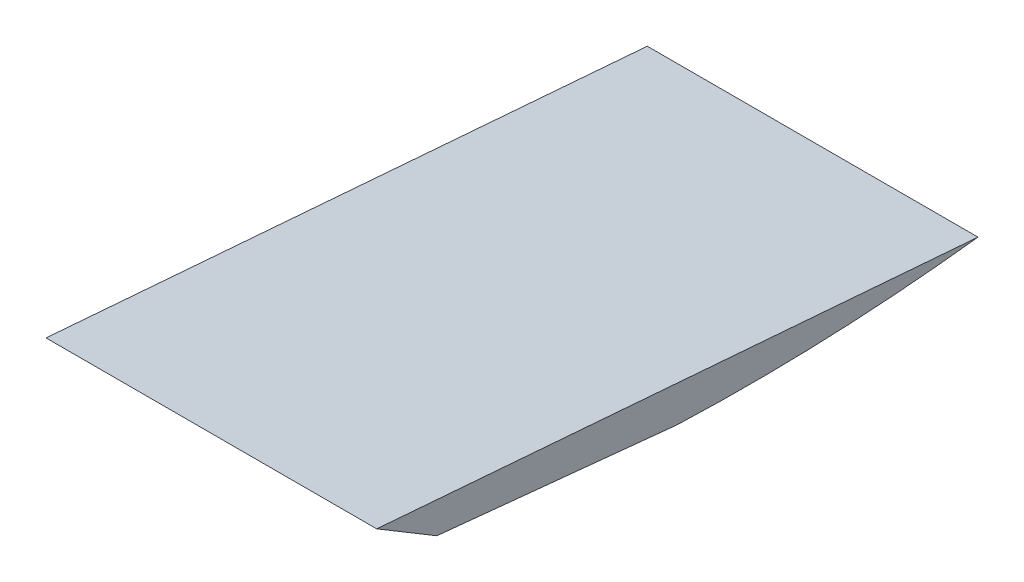
ISO-10303-21;
HEADER;
FILE_DESCRIPTION(('STEP AP214'),'2;1');
FILE_NAME('part.step','',(''),(''),'','','');
FILE_SCHEMA(('AUTOMOTIVE_DESIGN { 1 0 10303 214 1 1 1 1 }'));
ENDSEC;
DATA;
#1=APPLICATION_CONTEXT('core data for automotive mechanical design processes');
#2=APPLICATION_PROTOCOL_DEFINITION('international standard','automotive_design',2000,#1);
#3=PRODUCT_CONTEXT('',#1,'mechanical');
#4=PRODUCT('Part','Part','',(#3));
#5=PRODUCT_RELATED_PRODUCT_CATEGORY('part','',(#4));
#6=PRODUCT_DEFINITION_FORMATION('','',#4);
#7=PRODUCT_DEFINITION_CONTEXT('part definition',#1,'design');
#8=PRODUCT_DEFINITION('design','',#6,#7);
#9=PRODUCT_DEFINITION_SHAPE('','',#8);
#10=(LENGTH_UNIT() NAMED_UNIT(*) SI_UNIT(.MILLI.,.METRE.));
#11=(NAMED_UNIT(*) PLANE_ANGLE_UNIT() SI_UNIT($,.RADIAN.));
#12=(NAMED_UNIT(*) SI_UNIT($,.STERADIAN.) SOLID_ANGLE_UNIT());
#13=UNCERTAINTY_MEASURE_WITH_UNIT(LENGTH_MEASURE(1.E-05),#10,'distance_accuracy_value','');
#14=(GEOMETRIC_REPRESENTATION_CONTEXT(3) GLOBAL_UNCERTAINTY_ASSIGNED_CONTEXT((#13)) GLOBAL_UNIT_ASSIGNED_CONTEXT((#10,
#11,#12)) REPRESENTATION_CONTEXT('',''));
#15=CARTESIAN_POINT('',(0.,0.,0.));
#16=DIRECTION('',(0.,0.,1.));
#17=DIRECTION('',(1.,0.,0.));
#18=AXIS2_PLACEMENT_3D('',#15,#16,#17);
#19=CARTESIAN_POINT('',(13.75,3.,5.));
#20=DIRECTION('',(0.,0.857492925712544,-0.514495755427526));
#21=DIRECTION('',(0.,0.514495755427526,0.857492925712544));
#22=AXIS2_PLACEMENT_3D('',#19,#20,#21);
#23=PLANE('',#22);
#24=DIRECTION('',(0.,-0.514495755427526,-0.857492925712544));
#25=VECTOR('',#24,1.);
#26=CARTESIAN_POINT('',(-13.75,3.,5.));
#27=LINE('',#26,#25);
#28=CARTESIAN_POINT('',(-13.75,3.,5.));
#29=VERTEX_POINT('',#28);
#30=CARTESIAN_POINT('',(-13.75,0.,0.));
#31=VERTEX_POINT('',#30);
#32=EDGE_CURVE('E109',#29,#31,#27,.T.);
#33=ORIENTED_EDGE('',*,*,#32,.T.);
#34=DIRECTION('',(-1.,0.,0.));
#35=VECTOR('',#34,1.);
#36=CARTESIAN_POINT('',(13.75,0.,0.));
#37=LINE('',#36,#35);
#38=CARTESIAN_POINT('',(13.75,0.,0.));
#39=VERTEX_POINT('',#38);
#40=EDGE_CURVE('E11',#39,#31,#37,.T.);
#41=ORIENTED_EDGE('',*,*,#40,.F.);
#42=DIRECTION('',(0.,-0.514495755427526,-0.857492925712544));
#43=VECTOR('',#42,1.);
#44=CARTESIAN_POINT('',(13.75,3.,5.));
#45=LINE('',#44,#43);
#46=CARTESIAN_POINT('',(13.75,3.,5.));
#47=VERTEX_POINT('',#46);
#48=EDGE_CURVE('E93',#47,#39,#45,.T.);
#49=ORIENTED_EDGE('',*,*,#48,.F.);
#50=DIRECTION('',(-1.,0.,0.));
#51=VECTOR('',#50,1.);
#52=CARTESIAN_POINT('',(13.75,3.,5.));
#53=LINE('',#52,#51);
#54=EDGE_CURVE('E105',#47,#29,#53,.T.);
#55=ORIENTED_EDGE('',*,*,#54,.T.);
#56=EDGE_LOOP('',(#33,#41,#49,#55));
#57=FACE_BOUND('',#56,.T.);
#58=ADVANCED_FACE('F41',(#57),#23,.F.);
#59=CARTESIAN_POINT('',(13.75,0.,0.));
#60=DIRECTION('',(0.,0.995037190209989,-0.0995037190209989));
#61=DIRECTION('',(0.,0.0995037190209989,0.995037190209989));
#62=AXIS2_PLACEMENT_3D('',#59,#60,#61);
#63=PLANE('',#62);
#64=DIRECTION('',(0.,-0.0995037190209989,-0.995037190209989));
#65=VECTOR('',#64,1.);
#66=CARTESIAN_POINT('',(-13.75,0.,0.));
#67=LINE('',#66,#65);
#68=CARTESIAN_POINT('',(-13.75,-2.,-20.));
#69=VERTEX_POINT('',#68);
#70=EDGE_CURVE('E98',#31,#69,#67,.T.);
#71=ORIENTED_EDGE('',*,*,#70,.T.);
#72=DIRECTION('',(-1.,0.,0.));
#73=VECTOR('',#72,1.);
#74=CARTESIAN_POINT('',(13.75,-2.,-20.));
#75=LINE('',#74,#73);
#76=CARTESIAN_POINT('',(13.75,-2.,-20.));
#77=VERTEX_POINT('',#76);
#78=EDGE_CURVE('E50',#77,#69,#75,.T.);
#79=ORIENTED_EDGE('',*,*,#78,.F.);
#80=DIRECTION('',(0.,-0.0995037190209989,-0.995037190209989));
#81=VECTOR('',#80,1.);
#82=CARTESIAN_POINT('',(13.75,0.,0.));
#83=LINE('',#82,#81);
#84=EDGE_CURVE('E88',#39,#77,#83,.T.);
#85=ORIENTED_EDGE('',*,*,#84,.F.);
#86=ORIENTED_EDGE('',*,*,#40,.T.);
#87=EDGE_LOOP('',(#71,#79,#85,#86));
#88=FACE_BOUND('',#87,.T.);
#89=ADVANCED_FACE('F97',(#88),#63,.F.);
#90=CARTESIAN_POINT('',(13.75,157.88434424532,-26.0824719682095));
#91=DIRECTION('',(-1.,0.,0.));
#92=DIRECTION('',(0.,0.,1.));
#93=AXIS2_PLACEMENT_3D('',#90,#91,#92);
#94=CYLINDRICAL_SURFACE('',#93,160.);
#95=CARTESIAN_POINT('',(-13.75,157.88434424532,-26.0824719682095));
#96=DIRECTION('',(1.,0.,0.));
#97=DIRECTION('',(0.,0.,1.));
#98=AXIS2_PLACEMENT_3D('',#95,#96,#97);
#99=CIRCLE('',#98,160.);
#100=CARTESIAN_POINT('',(-13.75,-0.993367008230189,-45.));
#101=VERTEX_POINT('',#100);
#102=EDGE_CURVE('E75',#69,#101,#99,.T.);
#103=ORIENTED_EDGE('',*,*,#102,.T.);
#104=DIRECTION('',(-1.,0.,0.));
#105=VECTOR('',#104,1.);
#106=CARTESIAN_POINT('',(13.75,-0.993367008230189,-45.));
#107=LINE('',#106,#105);
#108=CARTESIAN_POINT('',(13.75,-0.993367008230189,-45.));
#109=VERTEX_POINT('',#108);
#110=EDGE_CURVE('E100',#109,#101,#107,.T.);
#111=ORIENTED_EDGE('',*,*,#110,.F.);
#112=CARTESIAN_POINT('',(13.75,157.88434424532,-26.0824719682095));
#113=DIRECTION('',(1.,0.,0.));
#114=DIRECTION('',(0.,0.,1.));
#115=AXIS2_PLACEMENT_3D('',#112,#113,#114);
#116=CIRCLE('',#115,160.);
#117=EDGE_CURVE('E91',#77,#109,#116,.T.);
#118=ORIENTED_EDGE('',*,*,#117,.F.);
#119=ORIENTED_EDGE('',*,*,#78,.T.);
#120=EDGE_LOOP('',(#103,#111,#118,#119));
#121=FACE_BOUND('',#120,.T.);
#122=ADVANCED_FACE('F101',(#121),#94,.T.);
#123=CARTESIAN_POINT('',(13.75,-0.993367008230173,-45.));
#124=DIRECTION('',(0.,-0.996825781699711,0.0796138237918575));
#125=DIRECTION('',(0.,-0.0796138237918575,-0.996825781699711));
#126=AXIS2_PLACEMENT_3D('',#123,#124,#125);
#127=PLANE('',#126);
#128=DIRECTION('',(0.,0.0796138237918575,0.996825781699711));
#129=VECTOR('',#128,1.);
#130=CARTESIAN_POINT('',(-13.75,-0.993367008230173,-45.));
#131=LINE('',#130,#129);
#132=EDGE_CURVE('E81',#101,#29,#131,.T.);
#133=ORIENTED_EDGE('',*,*,#132,.T.);
#134=ORIENTED_EDGE('',*,*,#54,.F.);
#135=DIRECTION('',(0.,0.0796138237918575,0.996825781699711));
#136=VECTOR('',#135,1.);
#137=CARTESIAN_POINT('',(13.75,-0.993367008230173,-45.));
#138=LINE('',#137,#136);
#139=EDGE_CURVE('E58',#109,#47,#138,.T.);
#140=ORIENTED_EDGE('',*,*,#139,.F.);
#141=ORIENTED_EDGE('',*,*,#110,.T.);
#142=EDGE_LOOP('',(#133,#134,#140,#141));
#143=FACE_BOUND('',#142,.T.);
#144=ADVANCED_FACE('F122',(#143),#127,.F.);
#145=CARTESIAN_POINT('',(13.75,157.88434424532,-26.0824719682095));
#146=DIRECTION('',(-1.,0.,0.));
#147=DIRECTION('',(0.,0.,1.));
#148=AXIS2_PLACEMENT_3D('',#145,#146,#147);
#149=PLANE('',#148);
#150=ORIENTED_EDGE('',*,*,#48,.T.);
#151=ORIENTED_EDGE('',*,*,#84,.T.);
#152=ORIENTED_EDGE('',*,*,#117,.T.);
#153=ORIENTED_EDGE('',*,*,#139,.T.);
#154=EDGE_LOOP('',(#150,#151,#152,#153));
#155=FACE_BOUND('',#154,.T.);
#156=ADVANCED_FACE('F89',(#155),#149,.F.);
#157=CARTESIAN_POINT('',(-13.75,157.88434424532,-26.0824719682095));
#158=DIRECTION('',(-1.,0.,0.));
#159=DIRECTION('',(0.,0.,1.));
#160=AXIS2_PLACEMENT_3D('',#157,#158,#159);
#161=PLANE('',#160);
#162=ORIENTED_EDGE('',*,*,#32,.F.);
#163=ORIENTED_EDGE('',*,*,#132,.F.);
#164=ORIENTED_EDGE('',*,*,#102,.F.);
#165=ORIENTED_EDGE('',*,*,#70,.F.);
#166=EDGE_LOOP('',(#162,#163,#164,#165));
#167=FACE_BOUND('',#166,.T.);
#168=ADVANCED_FACE('F125',(#167),#161,.T.);
#169=CLOSED_SHELL('',(#58,#89,#122,#144,#156,#168));
#170=MANIFOLD_SOLID_BREP('B2',#169);
#171=ADVANCED_BREP_SHAPE_REPRESENTATION('',(#18,#170),#14);
#172=SHAPE_DEFINITION_REPRESENTATION(#9,#171);
ENDSEC;
END-ISO-10303-21;
